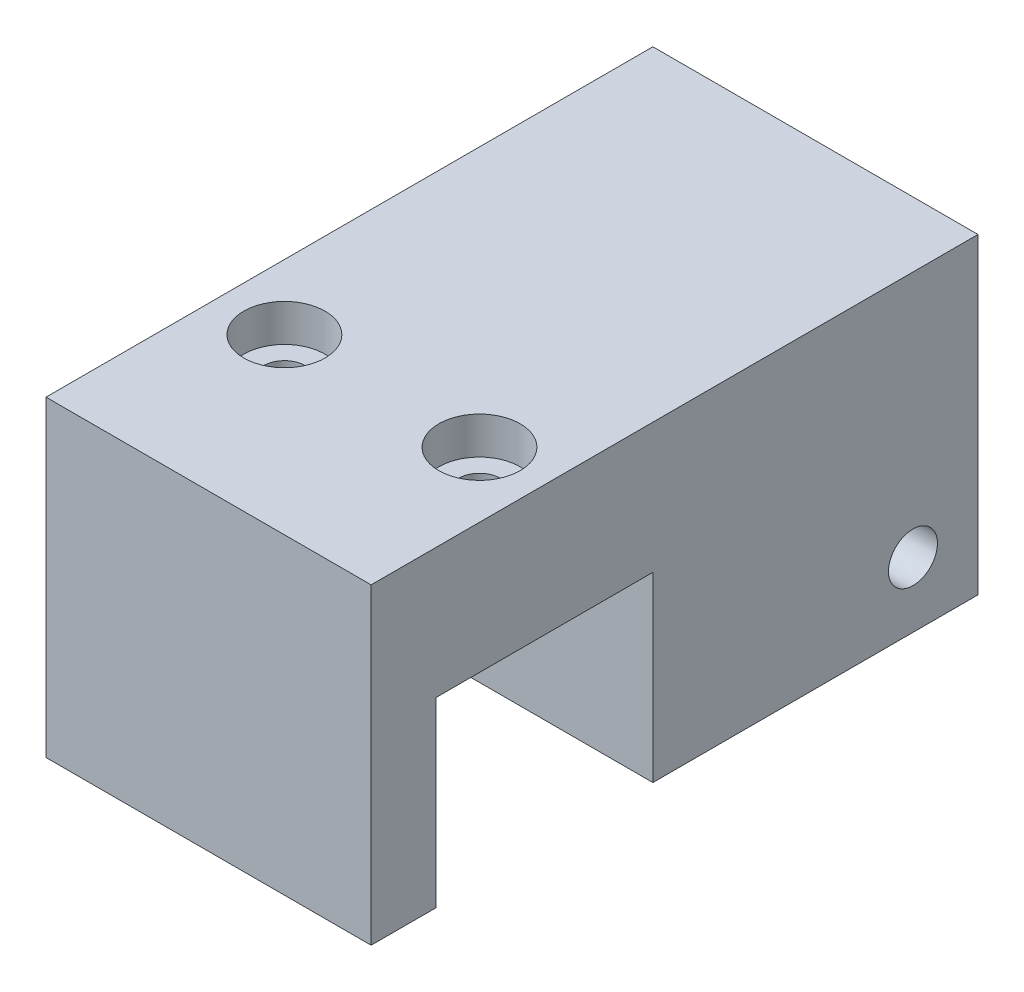
ISO-10303-21;
HEADER;
FILE_DESCRIPTION(('STEP AP214'),'2;1');
FILE_NAME('part.step','',(''),(''),'','','');
FILE_SCHEMA(('AUTOMOTIVE_DESIGN { 1 0 10303 214 1 1 1 1 }'));
ENDSEC;
DATA;
#1=APPLICATION_CONTEXT('core data for automotive mechanical design processes');
#2=APPLICATION_PROTOCOL_DEFINITION('international standard','automotive_design',2000,#1);
#3=PRODUCT_CONTEXT('',#1,'mechanical');
#4=PRODUCT('Part','Part','',(#3));
#5=PRODUCT_RELATED_PRODUCT_CATEGORY('part','',(#4));
#6=PRODUCT_DEFINITION_FORMATION('','',#4);
#7=PRODUCT_DEFINITION_CONTEXT('part definition',#1,'design');
#8=PRODUCT_DEFINITION('design','',#6,#7);
#9=PRODUCT_DEFINITION_SHAPE('','',#8);
#10=(LENGTH_UNIT() NAMED_UNIT(*) SI_UNIT(.MILLI.,.METRE.));
#11=(NAMED_UNIT(*) PLANE_ANGLE_UNIT() SI_UNIT($,.RADIAN.));
#12=(NAMED_UNIT(*) SI_UNIT($,.STERADIAN.) SOLID_ANGLE_UNIT());
#13=UNCERTAINTY_MEASURE_WITH_UNIT(LENGTH_MEASURE(1.E-05),#10,'distance_accuracy_value','');
#14=(GEOMETRIC_REPRESENTATION_CONTEXT(3) GLOBAL_UNCERTAINTY_ASSIGNED_CONTEXT((#13)) GLOBAL_UNIT_ASSIGNED_CONTEXT((#10,
#11,#12)) REPRESENTATION_CONTEXT('',''));
#15=CARTESIAN_POINT('',(0.,0.,0.));
#16=DIRECTION('',(0.,0.,1.));
#17=DIRECTION('',(1.,0.,0.));
#18=AXIS2_PLACEMENT_3D('',#15,#16,#17);
#19=CARTESIAN_POINT('',(19.05,0.,-10.16));
#20=DIRECTION('',(0.,0.,1.));
#21=DIRECTION('',(1.,0.,0.));
#22=AXIS2_PLACEMENT_3D('',#19,#20,#21);
#23=PLANE('',#22);
#24=DIRECTION('',(0.,1.,0.));
#25=VECTOR('',#24,1.);
#26=CARTESIAN_POINT('',(0.,0.,-10.16));
#27=LINE('',#26,#25);
#28=CARTESIAN_POINT('',(0.,0.,-10.16));
#29=VERTEX_POINT('',#28);
#30=CARTESIAN_POINT('',(0.,18.288,-10.16));
#31=VERTEX_POINT('',#30);
#32=EDGE_CURVE('E110',#29,#31,#27,.T.);
#33=ORIENTED_EDGE('',*,*,#32,.T.);
#34=DIRECTION('',(-1.,0.,0.));
#35=VECTOR('',#34,1.);
#36=CARTESIAN_POINT('',(19.05,18.288,-10.16));
#37=LINE('',#36,#35);
#38=CARTESIAN_POINT('',(19.05,18.288,-10.16));
#39=VERTEX_POINT('',#38);
#40=EDGE_CURVE('E11',#39,#31,#37,.T.);
#41=ORIENTED_EDGE('',*,*,#40,.F.);
#42=DIRECTION('',(0.,1.,0.));
#43=VECTOR('',#42,1.);
#44=CARTESIAN_POINT('',(19.05,0.,-10.16));
#45=LINE('',#44,#43);
#46=CARTESIAN_POINT('',(19.05,0.,-10.16));
#47=VERTEX_POINT('',#46);
#48=EDGE_CURVE('E111',#47,#39,#45,.T.);
#49=ORIENTED_EDGE('',*,*,#48,.F.);
#50=DIRECTION('',(-1.,0.,0.));
#51=VECTOR('',#50,1.);
#52=CARTESIAN_POINT('',(19.05,0.,-10.16));
#53=LINE('',#52,#51);
#54=EDGE_CURVE('E47',#47,#29,#53,.T.);
#55=ORIENTED_EDGE('',*,*,#54,.T.);
#56=EDGE_LOOP('',(#33,#41,#49,#55));
#57=FACE_BOUND('',#56,.T.);
#58=ADVANCED_FACE('F37',(#57),#23,.F.);
#59=CARTESIAN_POINT('',(19.05,18.288,0.));
#60=DIRECTION('',(0.,-1.,0.));
#61=DIRECTION('',(0.,0.,-1.));
#62=AXIS2_PLACEMENT_3D('',#59,#60,#61);
#63=PLANE('',#62);
#64=CARTESIAN_POINT('',(3.81,18.288,15.24));
#65=DIRECTION('',(0.,1.,0.));
#66=DIRECTION('',(0.,0.,1.));
#67=AXIS2_PLACEMENT_3D('',#64,#65,#66);
#68=CIRCLE('',#67,2.38124999999999);
#69=CARTESIAN_POINT('',(3.81,18.288,17.62125));
#70=VERTEX_POINT('',#69);
#71=EDGE_CURVE('E188',#70,#70,#68,.T.);
#72=ORIENTED_EDGE('',*,*,#71,.F.);
#73=EDGE_LOOP('',(#72));
#74=FACE_BOUND('',#73,.T.);
#75=CARTESIAN_POINT('',(15.24,18.288,15.24));
#76=DIRECTION('',(0.,1.,0.));
#77=DIRECTION('',(0.,0.,1.));
#78=AXIS2_PLACEMENT_3D('',#75,#76,#77);
#79=CIRCLE('',#78,2.38125);
#80=CARTESIAN_POINT('',(15.24,18.288,17.62125));
#81=VERTEX_POINT('',#80);
#82=EDGE_CURVE('E179',#81,#81,#79,.T.);
#83=ORIENTED_EDGE('',*,*,#82,.F.);
#84=EDGE_LOOP('',(#83));
#85=FACE_BOUND('',#84,.T.);
#86=DIRECTION('',(0.,0.,1.));
#87=VECTOR('',#86,1.);
#88=CARTESIAN_POINT('',(0.,18.288,0.));
#89=LINE('',#88,#87);
#90=CARTESIAN_POINT('',(0.,18.288,25.4));
#91=VERTEX_POINT('',#90);
#92=EDGE_CURVE('E97',#31,#91,#89,.T.);
#93=ORIENTED_EDGE('',*,*,#92,.T.);
#94=DIRECTION('',(-1.,0.,0.));
#95=VECTOR('',#94,1.);
#96=CARTESIAN_POINT('',(19.05,18.288,25.4));
#97=LINE('',#96,#95);
#98=CARTESIAN_POINT('',(19.05,18.288,25.4));
#99=VERTEX_POINT('',#98);
#100=EDGE_CURVE('E121',#99,#91,#97,.T.);
#101=ORIENTED_EDGE('',*,*,#100,.F.);
#102=DIRECTION('',(0.,0.,1.));
#103=VECTOR('',#102,1.);
#104=CARTESIAN_POINT('',(19.05,18.288,0.));
#105=LINE('',#104,#103);
#106=EDGE_CURVE('E170',#39,#99,#105,.T.);
#107=ORIENTED_EDGE('',*,*,#106,.F.);
#108=ORIENTED_EDGE('',*,*,#40,.T.);
#109=EDGE_LOOP('',(#93,#101,#107,#108));
#110=FACE_BOUND('',#109,.T.);
#111=ADVANCED_FACE('F236',(#74,#85,#110),#63,.F.);
#112=CARTESIAN_POINT('',(19.05,0.,0.));
#113=DIRECTION('',(0.,-1.,0.));
#114=DIRECTION('',(0.,0.,-1.));
#115=AXIS2_PLACEMENT_3D('',#112,#113,#114);
#116=PLANE('',#115);
#117=DIRECTION('',(0.,0.,1.));
#118=VECTOR('',#117,1.);
#119=CARTESIAN_POINT('',(0.,0.,0.));
#120=LINE('',#119,#118);
#121=CARTESIAN_POINT('',(0.,0.,8.89));
#122=VERTEX_POINT('',#121);
#123=EDGE_CURVE('E103',#29,#122,#120,.T.);
#124=ORIENTED_EDGE('',*,*,#123,.F.);
#125=ORIENTED_EDGE('',*,*,#54,.F.);
#126=DIRECTION('',(0.,0.,1.));
#127=VECTOR('',#126,1.);
#128=CARTESIAN_POINT('',(19.05,0.,0.));
#129=LINE('',#128,#127);
#130=CARTESIAN_POINT('',(19.05,0.,8.89));
#131=VERTEX_POINT('',#130);
#132=EDGE_CURVE('E117',#47,#131,#129,.T.);
#133=ORIENTED_EDGE('',*,*,#132,.T.);
#134=DIRECTION('',(-1.,0.,0.));
#135=VECTOR('',#134,1.);
#136=CARTESIAN_POINT('',(19.05,0.,8.89));
#137=LINE('',#136,#135);
#138=EDGE_CURVE('E114',#131,#122,#137,.T.);
#139=ORIENTED_EDGE('',*,*,#138,.T.);
#140=EDGE_LOOP('',(#124,#125,#133,#139));
#141=FACE_BOUND('',#140,.T.);
#142=ADVANCED_FACE('F115',(#141),#116,.T.);
#143=CARTESIAN_POINT('',(19.05,0.,0.));
#144=DIRECTION('',(1.,0.,0.));
#145=DIRECTION('',(0.,0.,-1.));
#146=AXIS2_PLACEMENT_3D('',#143,#144,#145);
#147=PLANE('',#146);
#148=CARTESIAN_POINT('',(19.05,3.81,-6.35));
#149=DIRECTION('',(-1.,0.,0.));
#150=DIRECTION('',(0.,0.,1.));
#151=AXIS2_PLACEMENT_3D('',#148,#149,#150);
#152=CIRCLE('',#151,1.4351);
#153=CARTESIAN_POINT('',(19.05,3.81,-4.9149));
#154=VERTEX_POINT('',#153);
#155=EDGE_CURVE('E191',#154,#154,#152,.T.);
#156=ORIENTED_EDGE('',*,*,#155,.T.);
#157=EDGE_LOOP('',(#156));
#158=FACE_BOUND('',#157,.T.);
#159=ORIENTED_EDGE('',*,*,#48,.T.);
#160=ORIENTED_EDGE('',*,*,#106,.T.);
#161=DIRECTION('',(0.,1.,0.));
#162=VECTOR('',#161,1.);
#163=CARTESIAN_POINT('',(19.05,0.,25.4));
#164=LINE('',#163,#162);
#165=CARTESIAN_POINT('',(19.05,0.,25.4));
#166=VERTEX_POINT('',#165);
#167=EDGE_CURVE('E134',#166,#99,#164,.T.);
#168=ORIENTED_EDGE('',*,*,#167,.F.);
#169=DIRECTION('',(0.,0.,-1.));
#170=VECTOR('',#169,1.);
#171=CARTESIAN_POINT('',(19.05,0.,25.4));
#172=LINE('',#171,#170);
#173=CARTESIAN_POINT('',(19.05,0.,21.59));
#174=VERTEX_POINT('',#173);
#175=EDGE_CURVE('E154',#166,#174,#172,.T.);
#176=ORIENTED_EDGE('',*,*,#175,.T.);
#177=DIRECTION('',(0.,1.,0.));
#178=VECTOR('',#177,1.);
#179=CARTESIAN_POINT('',(19.05,0.,21.59));
#180=LINE('',#179,#178);
#181=CARTESIAN_POINT('',(19.05,10.668,21.59));
#182=VERTEX_POINT('',#181);
#183=EDGE_CURVE('E157',#174,#182,#180,.T.);
#184=ORIENTED_EDGE('',*,*,#183,.T.);
#185=DIRECTION('',(0.,0.,-1.));
#186=VECTOR('',#185,1.);
#187=CARTESIAN_POINT('',(19.05,10.668,21.59));
#188=LINE('',#187,#186);
#189=CARTESIAN_POINT('',(19.05,10.668,8.89));
#190=VERTEX_POINT('',#189);
#191=EDGE_CURVE('E161',#182,#190,#188,.T.);
#192=ORIENTED_EDGE('',*,*,#191,.T.);
#193=DIRECTION('',(0.,1.,0.));
#194=VECTOR('',#193,1.);
#195=CARTESIAN_POINT('',(19.05,0.,8.89));
#196=LINE('',#195,#194);
#197=EDGE_CURVE('E142',#131,#190,#196,.T.);
#198=ORIENTED_EDGE('',*,*,#197,.F.);
#199=ORIENTED_EDGE('',*,*,#132,.F.);
#200=EDGE_LOOP('',(#159,#160,#168,#176,#184,#192,#198,#199));
#201=FACE_BOUND('',#200,.T.);
#202=ADVANCED_FACE('F202',(#158,#201),#147,.T.);
#203=CARTESIAN_POINT('',(0.,0.,0.));
#204=DIRECTION('',(1.,0.,0.));
#205=DIRECTION('',(0.,0.,-1.));
#206=AXIS2_PLACEMENT_3D('',#203,#204,#205);
#207=PLANE('',#206);
#208=CARTESIAN_POINT('',(0.,3.81,-6.35));
#209=DIRECTION('',(-1.,0.,0.));
#210=DIRECTION('',(0.,0.,1.));
#211=AXIS2_PLACEMENT_3D('',#208,#209,#210);
#212=CIRCLE('',#211,1.4351);
#213=CARTESIAN_POINT('',(0.,3.81,-4.9149));
#214=VERTEX_POINT('',#213);
#215=EDGE_CURVE('E194',#214,#214,#212,.T.);
#216=ORIENTED_EDGE('',*,*,#215,.F.);
#217=EDGE_LOOP('',(#216));
#218=FACE_BOUND('',#217,.T.);
#219=ORIENTED_EDGE('',*,*,#32,.F.);
#220=ORIENTED_EDGE('',*,*,#123,.T.);
#221=DIRECTION('',(0.,1.,0.));
#222=VECTOR('',#221,1.);
#223=CARTESIAN_POINT('',(0.,0.,8.89));
#224=LINE('',#223,#222);
#225=CARTESIAN_POINT('',(0.,10.668,8.89));
#226=VERTEX_POINT('',#225);
#227=EDGE_CURVE('E108',#122,#226,#224,.T.);
#228=ORIENTED_EDGE('',*,*,#227,.T.);
#229=DIRECTION('',(0.,0.,-1.));
#230=VECTOR('',#229,1.);
#231=CARTESIAN_POINT('',(0.,10.668,21.59));
#232=LINE('',#231,#230);
#233=CARTESIAN_POINT('',(0.,10.668,21.59));
#234=VERTEX_POINT('',#233);
#235=EDGE_CURVE('E126',#234,#226,#232,.T.);
#236=ORIENTED_EDGE('',*,*,#235,.F.);
#237=DIRECTION('',(0.,1.,0.));
#238=VECTOR('',#237,1.);
#239=CARTESIAN_POINT('',(0.,0.,21.59));
#240=LINE('',#239,#238);
#241=CARTESIAN_POINT('',(0.,0.,21.59));
#242=VERTEX_POINT('',#241);
#243=EDGE_CURVE('E129',#242,#234,#240,.T.);
#244=ORIENTED_EDGE('',*,*,#243,.F.);
#245=DIRECTION('',(0.,0.,-1.));
#246=VECTOR('',#245,1.);
#247=CARTESIAN_POINT('',(0.,0.,25.4));
#248=LINE('',#247,#246);
#249=CARTESIAN_POINT('',(0.,0.,25.4));
#250=VERTEX_POINT('',#249);
#251=EDGE_CURVE('E138',#250,#242,#248,.T.);
#252=ORIENTED_EDGE('',*,*,#251,.F.);
#253=DIRECTION('',(0.,1.,0.));
#254=VECTOR('',#253,1.);
#255=CARTESIAN_POINT('',(0.,0.,25.4));
#256=LINE('',#255,#254);
#257=EDGE_CURVE('E140',#250,#91,#256,.T.);
#258=ORIENTED_EDGE('',*,*,#257,.T.);
#259=ORIENTED_EDGE('',*,*,#92,.F.);
#260=EDGE_LOOP('',(#219,#220,#228,#236,#244,#252,#258,#259));
#261=FACE_BOUND('',#260,.T.);
#262=ADVANCED_FACE('F105',(#218,#261),#207,.F.);
#263=CARTESIAN_POINT('',(19.05,10.668,21.59));
#264=DIRECTION('',(0.,1.,0.));
#265=DIRECTION('',(0.,0.,1.));
#266=AXIS2_PLACEMENT_3D('',#263,#264,#265);
#267=PLANE('',#266);
#268=CARTESIAN_POINT('',(3.81,10.668,15.24));
#269=DIRECTION('',(0.,1.,0.));
#270=DIRECTION('',(0.,0.,1.));
#271=AXIS2_PLACEMENT_3D('',#268,#269,#270);
#272=CIRCLE('',#271,1.2192);
#273=CARTESIAN_POINT('',(3.81,10.668,16.4592));
#274=VERTEX_POINT('',#273);
#275=EDGE_CURVE('E41',#274,#274,#272,.T.);
#276=ORIENTED_EDGE('',*,*,#275,.T.);
#277=EDGE_LOOP('',(#276));
#278=FACE_BOUND('',#277,.T.);
#279=CARTESIAN_POINT('',(15.24,10.668,15.24));
#280=DIRECTION('',(0.,1.,0.));
#281=DIRECTION('',(0.,0.,1.));
#282=AXIS2_PLACEMENT_3D('',#279,#280,#281);
#283=CIRCLE('',#282,1.2192);
#284=CARTESIAN_POINT('',(15.24,10.668,16.4592));
#285=VERTEX_POINT('',#284);
#286=EDGE_CURVE('E127',#285,#285,#283,.T.);
#287=ORIENTED_EDGE('',*,*,#286,.T.);
#288=EDGE_LOOP('',(#287));
#289=FACE_BOUND('',#288,.T.);
#290=ORIENTED_EDGE('',*,*,#235,.T.);
#291=DIRECTION('',(-1.,0.,0.));
#292=VECTOR('',#291,1.);
#293=CARTESIAN_POINT('',(19.05,10.668,8.89));
#294=LINE('',#293,#292);
#295=EDGE_CURVE('E124',#190,#226,#294,.T.);
#296=ORIENTED_EDGE('',*,*,#295,.F.);
#297=ORIENTED_EDGE('',*,*,#191,.F.);
#298=DIRECTION('',(-1.,0.,0.));
#299=VECTOR('',#298,1.);
#300=CARTESIAN_POINT('',(19.05,10.668,21.59));
#301=LINE('',#300,#299);
#302=EDGE_CURVE('E150',#182,#234,#301,.T.);
#303=ORIENTED_EDGE('',*,*,#302,.T.);
#304=EDGE_LOOP('',(#290,#296,#297,#303));
#305=FACE_BOUND('',#304,.T.);
#306=ADVANCED_FACE('F201',(#278,#289,#305),#267,.F.);
#307=CARTESIAN_POINT('',(19.05,0.,21.59));
#308=DIRECTION('',(0.,0.,1.));
#309=DIRECTION('',(1.,0.,0.));
#310=AXIS2_PLACEMENT_3D('',#307,#308,#309);
#311=PLANE('',#310);
#312=ORIENTED_EDGE('',*,*,#243,.T.);
#313=ORIENTED_EDGE('',*,*,#302,.F.);
#314=ORIENTED_EDGE('',*,*,#183,.F.);
#315=DIRECTION('',(-1.,0.,0.));
#316=VECTOR('',#315,1.);
#317=CARTESIAN_POINT('',(19.05,0.,21.59));
#318=LINE('',#317,#316);
#319=EDGE_CURVE('E147',#174,#242,#318,.T.);
#320=ORIENTED_EDGE('',*,*,#319,.T.);
#321=EDGE_LOOP('',(#312,#313,#314,#320));
#322=FACE_BOUND('',#321,.T.);
#323=ADVANCED_FACE('F209',(#322),#311,.F.);
#324=CARTESIAN_POINT('',(19.05,0.,25.4));
#325=DIRECTION('',(0.,1.,0.));
#326=DIRECTION('',(0.,0.,1.));
#327=AXIS2_PLACEMENT_3D('',#324,#325,#326);
#328=PLANE('',#327);
#329=ORIENTED_EDGE('',*,*,#251,.T.);
#330=ORIENTED_EDGE('',*,*,#319,.F.);
#331=ORIENTED_EDGE('',*,*,#175,.F.);
#332=DIRECTION('',(-1.,0.,0.));
#333=VECTOR('',#332,1.);
#334=CARTESIAN_POINT('',(19.05,0.,25.4));
#335=LINE('',#334,#333);
#336=EDGE_CURVE('E145',#166,#250,#335,.T.);
#337=ORIENTED_EDGE('',*,*,#336,.T.);
#338=EDGE_LOOP('',(#329,#330,#331,#337));
#339=FACE_BOUND('',#338,.T.);
#340=ADVANCED_FACE('F220',(#339),#328,.F.);
#341=CARTESIAN_POINT('',(19.05,0.,8.89));
#342=DIRECTION('',(0.,0.,1.));
#343=DIRECTION('',(1.,0.,0.));
#344=AXIS2_PLACEMENT_3D('',#341,#342,#343);
#345=PLANE('',#344);
#346=ORIENTED_EDGE('',*,*,#227,.F.);
#347=ORIENTED_EDGE('',*,*,#138,.F.);
#348=ORIENTED_EDGE('',*,*,#197,.T.);
#349=ORIENTED_EDGE('',*,*,#295,.T.);
#350=EDGE_LOOP('',(#346,#347,#348,#349));
#351=FACE_BOUND('',#350,.T.);
#352=ADVANCED_FACE('F39',(#351),#345,.T.);
#353=CARTESIAN_POINT('',(19.05,0.,25.4));
#354=DIRECTION('',(0.,0.,1.));
#355=DIRECTION('',(1.,0.,0.));
#356=AXIS2_PLACEMENT_3D('',#353,#354,#355);
#357=PLANE('',#356);
#358=ORIENTED_EDGE('',*,*,#257,.F.);
#359=ORIENTED_EDGE('',*,*,#336,.F.);
#360=ORIENTED_EDGE('',*,*,#167,.T.);
#361=ORIENTED_EDGE('',*,*,#100,.T.);
#362=EDGE_LOOP('',(#358,#359,#360,#361));
#363=FACE_BOUND('',#362,.T.);
#364=ADVANCED_FACE('F216',(#363),#357,.T.);
#365=CARTESIAN_POINT('',(15.24,18.288,15.24));
#366=DIRECTION('',(0.,1.,0.));
#367=DIRECTION('',(0.,0.,1.));
#368=AXIS2_PLACEMENT_3D('',#365,#366,#367);
#369=CYLINDRICAL_SURFACE('',#368,1.2192);
#370=CARTESIAN_POINT('',(15.24,16.1036,15.24));
#371=DIRECTION('',(0.,1.,0.));
#372=DIRECTION('',(0.,0.,1.));
#373=AXIS2_PLACEMENT_3D('',#370,#371,#372);
#374=CIRCLE('',#373,1.2192);
#375=CARTESIAN_POINT('',(15.24,16.1036,16.4592));
#376=VERTEX_POINT('',#375);
#377=EDGE_CURVE('E132',#376,#376,#374,.T.);
#378=ORIENTED_EDGE('',*,*,#377,.T.);
#379=EDGE_LOOP('',(#378));
#380=FACE_BOUND('',#379,.T.);
#381=ORIENTED_EDGE('',*,*,#286,.F.);
#382=EDGE_LOOP('',(#381));
#383=FACE_BOUND('',#382,.T.);
#384=ADVANCED_FACE('F204',(#380,#383),#369,.F.);
#385=CARTESIAN_POINT('',(16.4592,16.1036,15.24));
#386=DIRECTION('',(0.,-1.,0.));
#387=DIRECTION('',(0.,0.,-1.));
#388=AXIS2_PLACEMENT_3D('',#385,#386,#387);
#389=PLANE('',#388);
#390=ORIENTED_EDGE('',*,*,#377,.F.);
#391=EDGE_LOOP('',(#390));
#392=FACE_BOUND('',#391,.T.);
#393=CARTESIAN_POINT('',(15.24,16.1036,15.24));
#394=DIRECTION('',(0.,1.,0.));
#395=DIRECTION('',(0.,0.,1.));
#396=AXIS2_PLACEMENT_3D('',#393,#394,#395);
#397=CIRCLE('',#396,2.38125);
#398=CARTESIAN_POINT('',(15.24,16.1036,17.62125));
#399=VERTEX_POINT('',#398);
#400=EDGE_CURVE('E176',#399,#399,#397,.T.);
#401=ORIENTED_EDGE('',*,*,#400,.T.);
#402=EDGE_LOOP('',(#401));
#403=FACE_BOUND('',#402,.T.);
#404=ADVANCED_FACE('F215',(#392,#403),#389,.F.);
#405=CARTESIAN_POINT('',(15.24,18.288,15.24));
#406=DIRECTION('',(0.,1.,0.));
#407=DIRECTION('',(0.,0.,1.));
#408=AXIS2_PLACEMENT_3D('',#405,#406,#407);
#409=CYLINDRICAL_SURFACE('',#408,2.38125);
#410=ORIENTED_EDGE('',*,*,#400,.F.);
#411=EDGE_LOOP('',(#410));
#412=FACE_BOUND('',#411,.T.);
#413=ORIENTED_EDGE('',*,*,#82,.T.);
#414=EDGE_LOOP('',(#413));
#415=FACE_BOUND('',#414,.T.);
#416=ADVANCED_FACE('F294',(#412,#415),#409,.F.);
#417=CARTESIAN_POINT('',(3.81,18.288,15.24));
#418=DIRECTION('',(0.,1.,0.));
#419=DIRECTION('',(0.,0.,1.));
#420=AXIS2_PLACEMENT_3D('',#417,#418,#419);
#421=CYLINDRICAL_SURFACE('',#420,1.2192);
#422=CARTESIAN_POINT('',(3.81,16.1036,15.24));
#423=DIRECTION('',(0.,1.,0.));
#424=DIRECTION('',(0.,0.,1.));
#425=AXIS2_PLACEMENT_3D('',#422,#423,#424);
#426=CIRCLE('',#425,1.2192);
#427=CARTESIAN_POINT('',(3.81,16.1036,16.4592));
#428=VERTEX_POINT('',#427);
#429=EDGE_CURVE('E182',#428,#428,#426,.T.);
#430=ORIENTED_EDGE('',*,*,#429,.T.);
#431=EDGE_LOOP('',(#430));
#432=FACE_BOUND('',#431,.T.);
#433=ORIENTED_EDGE('',*,*,#275,.F.);
#434=EDGE_LOOP('',(#433));
#435=FACE_BOUND('',#434,.T.);
#436=ADVANCED_FACE('F286',(#432,#435),#421,.F.);
#437=CARTESIAN_POINT('',(5.0292,16.1036,15.24));
#438=DIRECTION('',(0.,-1.,0.));
#439=DIRECTION('',(0.,0.,-1.));
#440=AXIS2_PLACEMENT_3D('',#437,#438,#439);
#441=PLANE('',#440);
#442=ORIENTED_EDGE('',*,*,#429,.F.);
#443=EDGE_LOOP('',(#442));
#444=FACE_BOUND('',#443,.T.);
#445=CARTESIAN_POINT('',(3.81,16.1036,15.24));
#446=DIRECTION('',(0.,1.,0.));
#447=DIRECTION('',(0.,0.,1.));
#448=AXIS2_PLACEMENT_3D('',#445,#446,#447);
#449=CIRCLE('',#448,2.38125);
#450=CARTESIAN_POINT('',(3.81,16.1036,17.62125));
#451=VERTEX_POINT('',#450);
#452=EDGE_CURVE('E185',#451,#451,#449,.T.);
#453=ORIENTED_EDGE('',*,*,#452,.T.);
#454=EDGE_LOOP('',(#453));
#455=FACE_BOUND('',#454,.T.);
#456=ADVANCED_FACE('F281',(#444,#455),#441,.F.);
#457=CARTESIAN_POINT('',(3.81,18.288,15.24));
#458=DIRECTION('',(0.,1.,0.));
#459=DIRECTION('',(0.,0.,1.));
#460=AXIS2_PLACEMENT_3D('',#457,#458,#459);
#461=CYLINDRICAL_SURFACE('',#460,2.38124999999999);
#462=ORIENTED_EDGE('',*,*,#452,.F.);
#463=EDGE_LOOP('',(#462));
#464=FACE_BOUND('',#463,.T.);
#465=ORIENTED_EDGE('',*,*,#71,.T.);
#466=EDGE_LOOP('',(#465));
#467=FACE_BOUND('',#466,.T.);
#468=ADVANCED_FACE('F258',(#464,#467),#461,.F.);
#469=CARTESIAN_POINT('',(0.,3.81,-6.35));
#470=DIRECTION('',(-1.,0.,0.));
#471=DIRECTION('',(0.,0.,1.));
#472=AXIS2_PLACEMENT_3D('',#469,#470,#471);
#473=CYLINDRICAL_SURFACE('',#472,1.4351);
#474=ORIENTED_EDGE('',*,*,#155,.F.);
#475=EDGE_LOOP('',(#474));
#476=FACE_BOUND('',#475,.T.);
#477=ORIENTED_EDGE('',*,*,#215,.T.);
#478=EDGE_LOOP('',(#477));
#479=FACE_BOUND('',#478,.T.);
#480=ADVANCED_FACE('F198',(#476,#479),#473,.F.);
#481=CLOSED_SHELL('',(#58,#111,#142,#202,#262,#306,#323,#340,#352,#364,#384,#404,#416,#436,#456,
#468,#480));
#482=MANIFOLD_SOLID_BREP('B2',#481);
#483=ADVANCED_BREP_SHAPE_REPRESENTATION('',(#18,#482),#14);
#484=SHAPE_DEFINITION_REPRESENTATION(#9,#483);
ENDSEC;
END-ISO-10303-21;
